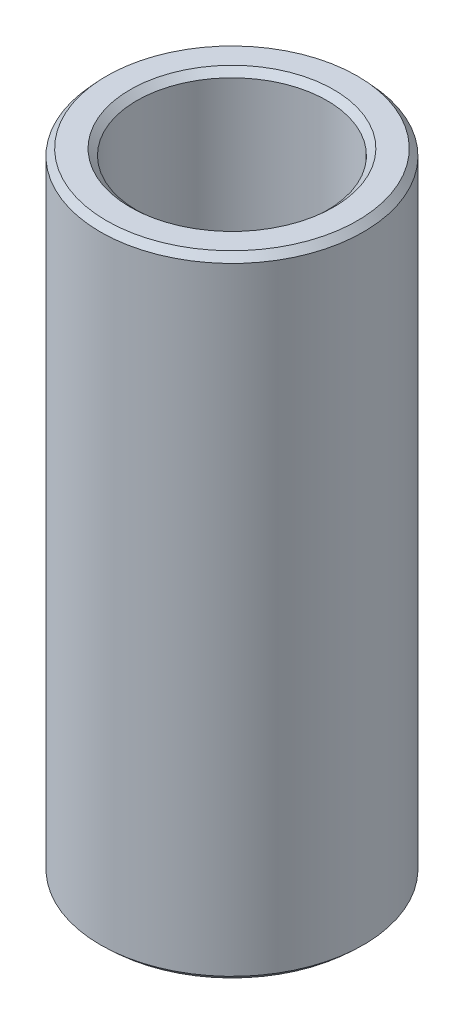
ISO-10303-21;
HEADER;
FILE_DESCRIPTION(('STEP AP214'),'2;1');
FILE_NAME('part.step','',(''),(''),'','','');
FILE_SCHEMA(('AUTOMOTIVE_DESIGN { 1 0 10303 214 1 1 1 1 }'));
ENDSEC;
DATA;
#1=APPLICATION_CONTEXT('core data for automotive mechanical design processes');
#2=APPLICATION_PROTOCOL_DEFINITION('international standard','automotive_design',2000,#1);
#3=PRODUCT_CONTEXT('',#1,'mechanical');
#4=PRODUCT('Part','Part','',(#3));
#5=PRODUCT_RELATED_PRODUCT_CATEGORY('part','',(#4));
#6=PRODUCT_DEFINITION_FORMATION('','',#4);
#7=PRODUCT_DEFINITION_CONTEXT('part definition',#1,'design');
#8=PRODUCT_DEFINITION('design','',#6,#7);
#9=PRODUCT_DEFINITION_SHAPE('','',#8);
#10=(LENGTH_UNIT() NAMED_UNIT(*) SI_UNIT(.MILLI.,.METRE.));
#11=(NAMED_UNIT(*) PLANE_ANGLE_UNIT() SI_UNIT($,.RADIAN.));
#12=(NAMED_UNIT(*) SI_UNIT($,.STERADIAN.) SOLID_ANGLE_UNIT());
#13=UNCERTAINTY_MEASURE_WITH_UNIT(LENGTH_MEASURE(1.E-05),#10,'distance_accuracy_value','');
#14=(GEOMETRIC_REPRESENTATION_CONTEXT(3) GLOBAL_UNCERTAINTY_ASSIGNED_CONTEXT((#13)) GLOBAL_UNIT_ASSIGNED_CONTEXT((#10,
#11,#12)) REPRESENTATION_CONTEXT('',''));
#15=CARTESIAN_POINT('',(0.,0.,0.));
#16=DIRECTION('',(0.,0.,1.));
#17=DIRECTION('',(1.,0.,0.));
#18=AXIS2_PLACEMENT_3D('',#15,#16,#17);
#19=CARTESIAN_POINT('',(0.,239.547411143379,0.));
#20=DIRECTION('',(0.,-1.,0.));
#21=DIRECTION('',(0.,0.,-1.));
#22=AXIS2_PLACEMENT_3D('',#19,#20,#21);
#23=CYLINDRICAL_SURFACE('',#22,50.);
#24=CARTESIAN_POINT('',(0.,2.33097219052419,0.));
#25=DIRECTION('',(0.,1.,0.));
#26=DIRECTION('',(0.,0.,1.));
#27=AXIS2_PLACEMENT_3D('',#24,#25,#26);
#28=CIRCLE('',#27,50.);
#29=CARTESIAN_POINT('',(0.,2.33097219052419,50.));
#30=VERTEX_POINT('',#29);
#31=EDGE_CURVE('E10',#30,#30,#28,.T.);
#32=ORIENTED_EDGE('',*,*,#31,.T.);
#33=EDGE_LOOP('',(#32));
#34=FACE_BOUND('',#33,.T.);
#35=CARTESIAN_POINT('',(0.,237.013039357102,0.));
#36=DIRECTION('',(0.,1.,0.));
#37=DIRECTION('',(0.,0.,1.));
#38=AXIS2_PLACEMENT_3D('',#35,#36,#37);
#39=CIRCLE('',#38,50.);
#40=CARTESIAN_POINT('',(0.,237.013039357102,50.));
#41=VERTEX_POINT('',#40);
#42=EDGE_CURVE('E50',#41,#41,#39,.F.);
#43=ORIENTED_EDGE('',*,*,#42,.T.);
#44=EDGE_LOOP('',(#43));
#45=FACE_BOUND('',#44,.T.);
#46=ADVANCED_FACE('F39',(#34,#45),#23,.T.);
#47=CARTESIAN_POINT('',(0.,239.547411143379,0.));
#48=DIRECTION('',(0.,1.,0.));
#49=DIRECTION('',(0.,0.,1.));
#50=AXIS2_PLACEMENT_3D('',#47,#48,#49);
#51=PLANE('',#50);
#52=CARTESIAN_POINT('',(0.,239.547411143379,0.));
#53=DIRECTION('',(0.,1.,0.));
#54=DIRECTION('',(0.,0.,1.));
#55=AXIS2_PLACEMENT_3D('',#52,#53,#54);
#56=CIRCLE('',#55,38.693021089474);
#57=CARTESIAN_POINT('',(0.,239.547411143379,38.693021089474));
#58=VERTEX_POINT('',#57);
#59=EDGE_CURVE('E58',#58,#58,#56,.F.);
#60=ORIENTED_EDGE('',*,*,#59,.T.);
#61=EDGE_LOOP('',(#60));
#62=FACE_BOUND('',#61,.T.);
#63=CARTESIAN_POINT('',(0.,239.547411143379,0.));
#64=DIRECTION('',(0.,1.,0.));
#65=DIRECTION('',(0.,0.,1.));
#66=AXIS2_PLACEMENT_3D('',#63,#64,#65);
#67=CIRCLE('',#66,47.6690278094758);
#68=CARTESIAN_POINT('',(0.,239.547411143379,47.6690278094758));
#69=VERTEX_POINT('',#68);
#70=EDGE_CURVE('E61',#69,#69,#67,.T.);
#71=ORIENTED_EDGE('',*,*,#70,.T.);
#72=EDGE_LOOP('',(#71));
#73=FACE_BOUND('',#72,.T.);
#74=ADVANCED_FACE('F88',(#62,#73),#51,.T.);
#75=CARTESIAN_POINT('',(0.,0.,0.));
#76=DIRECTION('',(0.,1.,0.));
#77=DIRECTION('',(0.,0.,1.));
#78=AXIS2_PLACEMENT_3D('',#75,#76,#77);
#79=PLANE('',#78);
#80=CARTESIAN_POINT('',(0.,0.,0.));
#81=DIRECTION('',(0.,1.,0.));
#82=DIRECTION('',(0.,0.,1.));
#83=AXIS2_PLACEMENT_3D('',#80,#81,#82);
#84=CIRCLE('',#83,38.4896214937215);
#85=CARTESIAN_POINT('',(0.,0.,38.4896214937215));
#86=VERTEX_POINT('',#85);
#87=EDGE_CURVE('E51',#86,#86,#84,.T.);
#88=ORIENTED_EDGE('',*,*,#87,.T.);
#89=EDGE_LOOP('',(#88));
#90=FACE_BOUND('',#89,.T.);
#91=CARTESIAN_POINT('',(0.,0.,0.));
#92=DIRECTION('',(0.,1.,0.));
#93=DIRECTION('',(0.,0.,1.));
#94=AXIS2_PLACEMENT_3D('',#91,#92,#93);
#95=CIRCLE('',#94,47.4656282137234);
#96=CARTESIAN_POINT('',(0.,0.,47.4656282137234));
#97=VERTEX_POINT('',#96);
#98=EDGE_CURVE('E54',#97,#97,#95,.F.);
#99=ORIENTED_EDGE('',*,*,#98,.T.);
#100=EDGE_LOOP('',(#99));
#101=FACE_BOUND('',#100,.T.);
#102=ADVANCED_FACE('F83',(#90,#101),#79,.F.);
#103=CARTESIAN_POINT('',(0.,239.547411143379,0.));
#104=DIRECTION('',(0.,-1.,0.));
#105=DIRECTION('',(0.,0.,-1.));
#106=AXIS2_PLACEMENT_3D('',#103,#104,#105);
#107=CYLINDRICAL_SURFACE('',#106,36.1586493031973);
#108=CARTESIAN_POINT('',(0.,237.216438952855,0.));
#109=DIRECTION('',(0.,1.,0.));
#110=DIRECTION('',(0.,0.,1.));
#111=AXIS2_PLACEMENT_3D('',#108,#109,#110);
#112=CIRCLE('',#111,36.1586493031973);
#113=CARTESIAN_POINT('',(0.,237.216438952855,36.1586493031973));
#114=VERTEX_POINT('',#113);
#115=EDGE_CURVE('E67',#114,#114,#112,.T.);
#116=ORIENTED_EDGE('',*,*,#115,.T.);
#117=EDGE_LOOP('',(#116));
#118=FACE_BOUND('',#117,.T.);
#119=CARTESIAN_POINT('',(0.,2.53437178627663,0.));
#120=DIRECTION('',(0.,1.,0.));
#121=DIRECTION('',(0.,0.,1.));
#122=AXIS2_PLACEMENT_3D('',#119,#120,#121);
#123=CIRCLE('',#122,36.1586493031973);
#124=CARTESIAN_POINT('',(0.,2.53437178627663,36.1586493031973));
#125=VERTEX_POINT('',#124);
#126=EDGE_CURVE('E69',#125,#125,#123,.F.);
#127=ORIENTED_EDGE('',*,*,#126,.T.);
#128=EDGE_LOOP('',(#127));
#129=FACE_BOUND('',#128,.T.);
#130=ADVANCED_FACE('F71',(#118,#129),#107,.F.);
#131=CARTESIAN_POINT('',(0.,237.216438952855,0.));
#132=DIRECTION('',(0.,1.,0.));
#133=DIRECTION('',(0.,0.,1.));
#134=AXIS2_PLACEMENT_3D('',#131,#132,#133);
#135=CONICAL_SURFACE('',#134,36.1586493031973,0.827179633590188);
#136=ORIENTED_EDGE('',*,*,#59,.F.);
#137=EDGE_LOOP('',(#136));
#138=FACE_BOUND('',#137,.T.);
#139=ORIENTED_EDGE('',*,*,#115,.F.);
#140=EDGE_LOOP('',(#139));
#141=FACE_BOUND('',#140,.T.);
#142=ADVANCED_FACE('F77',(#138,#141),#135,.F.);
#143=CARTESIAN_POINT('',(0.,0.,0.));
#144=DIRECTION('',(0.,-1.,0.));
#145=DIRECTION('',(0.,0.,-1.));
#146=AXIS2_PLACEMENT_3D('',#143,#144,#145);
#147=CONICAL_SURFACE('',#146,38.4896214937215,0.743616693204705);
#148=ORIENTED_EDGE('',*,*,#126,.F.);
#149=EDGE_LOOP('',(#148));
#150=FACE_BOUND('',#149,.T.);
#151=ORIENTED_EDGE('',*,*,#87,.F.);
#152=EDGE_LOOP('',(#151));
#153=FACE_BOUND('',#152,.T.);
#154=ADVANCED_FACE('F73',(#150,#153),#147,.F.);
#155=CARTESIAN_POINT('',(0.,2.33097219052419,0.));
#156=DIRECTION('',(0.,1.,0.));
#157=DIRECTION('',(0.,0.,1.));
#158=AXIS2_PLACEMENT_3D('',#155,#156,#157);
#159=CONICAL_SURFACE('',#158,50.,0.827179633590186);
#160=ORIENTED_EDGE('',*,*,#98,.F.);
#161=EDGE_LOOP('',(#160));
#162=FACE_BOUND('',#161,.T.);
#163=ORIENTED_EDGE('',*,*,#31,.F.);
#164=EDGE_LOOP('',(#163));
#165=FACE_BOUND('',#164,.T.);
#166=ADVANCED_FACE('F76',(#162,#165),#159,.T.);
#167=CARTESIAN_POINT('',(0.,239.547411143379,0.));
#168=DIRECTION('',(0.,-1.,0.));
#169=DIRECTION('',(0.,0.,-1.));
#170=AXIS2_PLACEMENT_3D('',#167,#168,#169);
#171=CONICAL_SURFACE('',#170,47.6690278094758,0.743616693204704);
#172=ORIENTED_EDGE('',*,*,#42,.F.);
#173=EDGE_LOOP('',(#172));
#174=FACE_BOUND('',#173,.T.);
#175=ORIENTED_EDGE('',*,*,#70,.F.);
#176=EDGE_LOOP('',(#175));
#177=FACE_BOUND('',#176,.T.);
#178=ADVANCED_FACE('F45',(#174,#177),#171,.T.);
#179=CLOSED_SHELL('',(#46,#74,#102,#130,#142,#154,#166,#178));
#180=MANIFOLD_SOLID_BREP('B2',#179);
#181=ADVANCED_BREP_SHAPE_REPRESENTATION('',(#18,#180),#14);
#182=SHAPE_DEFINITION_REPRESENTATION(#9,#181);
ENDSEC;
END-ISO-10303-21;
